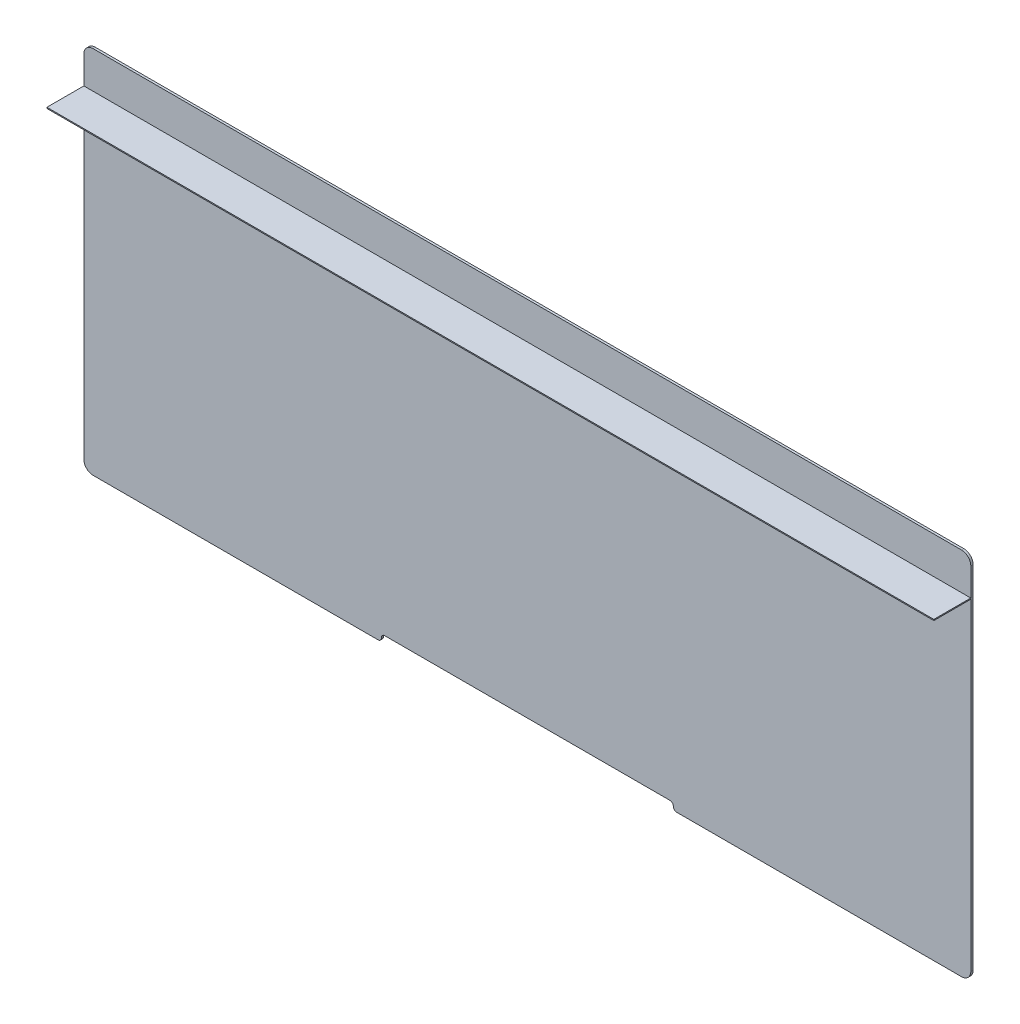
ISO-10303-21;
HEADER;
FILE_DESCRIPTION(('STEP AP214'),'2;1');
FILE_NAME('part.step','',(''),(''),'','','');
FILE_SCHEMA(('AUTOMOTIVE_DESIGN { 1 0 10303 214 1 1 1 1 }'));
ENDSEC;
DATA;
#1=APPLICATION_CONTEXT('core data for automotive mechanical design processes');
#2=APPLICATION_PROTOCOL_DEFINITION('international standard','automotive_design',2000,#1);
#3=PRODUCT_CONTEXT('',#1,'mechanical');
#4=PRODUCT('Part','Part','',(#3));
#5=PRODUCT_RELATED_PRODUCT_CATEGORY('part','',(#4));
#6=PRODUCT_DEFINITION_FORMATION('','',#4);
#7=PRODUCT_DEFINITION_CONTEXT('part definition',#1,'design');
#8=PRODUCT_DEFINITION('design','',#6,#7);
#9=PRODUCT_DEFINITION_SHAPE('','',#8);
#10=(LENGTH_UNIT() NAMED_UNIT(*) SI_UNIT(.MILLI.,.METRE.));
#11=(NAMED_UNIT(*) PLANE_ANGLE_UNIT() SI_UNIT($,.RADIAN.));
#12=(NAMED_UNIT(*) SI_UNIT($,.STERADIAN.) SOLID_ANGLE_UNIT());
#13=UNCERTAINTY_MEASURE_WITH_UNIT(LENGTH_MEASURE(1.E-05),#10,'distance_accuracy_value','');
#14=(GEOMETRIC_REPRESENTATION_CONTEXT(3) GLOBAL_UNCERTAINTY_ASSIGNED_CONTEXT((#13)) GLOBAL_UNIT_ASSIGNED_CONTEXT((#10,
#11,#12)) REPRESENTATION_CONTEXT('',''));
#15=CARTESIAN_POINT('',(0.,0.,0.));
#16=DIRECTION('',(0.,0.,1.));
#17=DIRECTION('',(1.,0.,0.));
#18=AXIS2_PLACEMENT_3D('',#15,#16,#17);
#19=CARTESIAN_POINT('',(-416.107853403142,106.182771727749,26.9875));
#20=DIRECTION('',(0.,1.,0.));
#21=DIRECTION('',(-1.,0.,0.));
#22=AXIS2_PLACEMENT_3D('',#19,#20,#21);
#23=PLANE('',#22);
#24=DIRECTION('',(1.,0.,0.));
#25=VECTOR('',#24,1.);
#26=CARTESIAN_POINT('',(-416.107853403142,106.182771727749,1.5875));
#27=LINE('',#26,#25);
#28=CARTESIAN_POINT('',(-416.107853403142,106.182771727749,1.5875));
#29=VERTEX_POINT('',#28);
#30=CARTESIAN_POINT('',(193.492146596859,106.182771727749,1.5875));
#31=VERTEX_POINT('',#30);
#32=EDGE_CURVE('E114',#29,#31,#27,.T.);
#33=ORIENTED_EDGE('',*,*,#32,.T.);
#34=DIRECTION('',(0.,0.,-1.));
#35=VECTOR('',#34,1.);
#36=CARTESIAN_POINT('',(193.492146596859,106.182771727749,26.9875));
#37=LINE('',#36,#35);
#38=CARTESIAN_POINT('',(193.492146596859,106.182771727749,26.9875));
#39=VERTEX_POINT('',#38);
#40=EDGE_CURVE('E12',#39,#31,#37,.T.);
#41=ORIENTED_EDGE('',*,*,#40,.F.);
#42=DIRECTION('',(1.,0.,0.));
#43=VECTOR('',#42,1.);
#44=CARTESIAN_POINT('',(-416.107853403142,106.182771727749,26.9875));
#45=LINE('',#44,#43);
#46=CARTESIAN_POINT('',(-416.107853403142,106.182771727749,26.9875));
#47=VERTEX_POINT('',#46);
#48=EDGE_CURVE('E91',#47,#39,#45,.T.);
#49=ORIENTED_EDGE('',*,*,#48,.F.);
#50=DIRECTION('',(0.,0.,-1.));
#51=VECTOR('',#50,1.);
#52=CARTESIAN_POINT('',(-416.107853403142,106.182771727749,26.9875));
#53=LINE('',#52,#51);
#54=EDGE_CURVE('E67',#47,#29,#53,.T.);
#55=ORIENTED_EDGE('',*,*,#54,.T.);
#56=EDGE_LOOP('',(#33,#41,#49,#55));
#57=FACE_BOUND('',#56,.T.);
#58=ADVANCED_FACE('F51',(#57),#23,.F.);
#59=CARTESIAN_POINT('',(193.492146596859,106.919371727749,26.9875));
#60=DIRECTION('',(1.,0.,0.));
#61=DIRECTION('',(0.,1.,0.));
#62=AXIS2_PLACEMENT_3D('',#59,#60,#61);
#63=PLANE('',#62);
#64=DIRECTION('',(0.,-1.,0.));
#65=VECTOR('',#64,1.);
#66=CARTESIAN_POINT('',(193.492146596859,106.919371727749,1.5875));
#67=LINE('',#66,#65);
#68=CARTESIAN_POINT('',(193.492146596859,106.919371727749,1.5875));
#69=VERTEX_POINT('',#68);
#70=EDGE_CURVE('E100',#69,#31,#67,.T.);
#71=ORIENTED_EDGE('',*,*,#70,.F.);
#72=DIRECTION('',(0.,0.,-1.));
#73=VECTOR('',#72,1.);
#74=CARTESIAN_POINT('',(193.492146596859,106.919371727749,26.9875));
#75=LINE('',#74,#73);
#76=CARTESIAN_POINT('',(193.492146596859,106.919371727749,26.9875));
#77=VERTEX_POINT('',#76);
#78=EDGE_CURVE('E59',#77,#69,#75,.T.);
#79=ORIENTED_EDGE('',*,*,#78,.F.);
#80=DIRECTION('',(0.,-1.,0.));
#81=VECTOR('',#80,1.);
#82=CARTESIAN_POINT('',(193.492146596859,106.919371727749,26.9875));
#83=LINE('',#82,#81);
#84=EDGE_CURVE('E98',#77,#39,#83,.T.);
#85=ORIENTED_EDGE('',*,*,#84,.T.);
#86=ORIENTED_EDGE('',*,*,#40,.T.);
#87=EDGE_LOOP('',(#71,#79,#85,#86));
#88=FACE_BOUND('',#87,.T.);
#89=ADVANCED_FACE('F97',(#88),#63,.T.);
#90=CARTESIAN_POINT('',(-416.107853403142,106.919371727749,26.9875));
#91=DIRECTION('',(0.,1.,0.));
#92=DIRECTION('',(-1.,0.,0.));
#93=AXIS2_PLACEMENT_3D('',#90,#91,#92);
#94=PLANE('',#93);
#95=DIRECTION('',(1.,0.,0.));
#96=VECTOR('',#95,1.);
#97=CARTESIAN_POINT('',(-416.107853403142,106.919371727749,1.5875));
#98=LINE('',#97,#96);
#99=CARTESIAN_POINT('',(-416.107853403142,106.919371727749,1.5875));
#100=VERTEX_POINT('',#99);
#101=EDGE_CURVE('E117',#100,#69,#98,.T.);
#102=ORIENTED_EDGE('',*,*,#101,.F.);
#103=DIRECTION('',(0.,0.,-1.));
#104=VECTOR('',#103,1.);
#105=CARTESIAN_POINT('',(-416.107853403142,106.919371727749,26.9875));
#106=LINE('',#105,#104);
#107=CARTESIAN_POINT('',(-416.107853403142,106.919371727749,26.9875));
#108=VERTEX_POINT('',#107);
#109=EDGE_CURVE('E80',#108,#100,#106,.T.);
#110=ORIENTED_EDGE('',*,*,#109,.F.);
#111=DIRECTION('',(1.,0.,0.));
#112=VECTOR('',#111,1.);
#113=CARTESIAN_POINT('',(-416.107853403142,106.919371727749,26.9875));
#114=LINE('',#113,#112);
#115=EDGE_CURVE('E106',#108,#77,#114,.T.);
#116=ORIENTED_EDGE('',*,*,#115,.T.);
#117=ORIENTED_EDGE('',*,*,#78,.T.);
#118=EDGE_LOOP('',(#102,#110,#116,#117));
#119=FACE_BOUND('',#118,.T.);
#120=ADVANCED_FACE('F108',(#119),#94,.T.);
#121=CARTESIAN_POINT('',(-416.107853403142,106.182771727749,26.9875));
#122=DIRECTION('',(-1.,0.,0.));
#123=DIRECTION('',(0.,0.,1.));
#124=AXIS2_PLACEMENT_3D('',#121,#122,#123);
#125=PLANE('',#124);
#126=DIRECTION('',(0.,1.,0.));
#127=VECTOR('',#126,1.);
#128=CARTESIAN_POINT('',(-416.107853403142,106.182771727749,1.5875));
#129=LINE('',#128,#127);
#130=EDGE_CURVE('E119',#29,#100,#129,.T.);
#131=ORIENTED_EDGE('',*,*,#130,.F.);
#132=ORIENTED_EDGE('',*,*,#54,.F.);
#133=DIRECTION('',(0.,1.,0.));
#134=VECTOR('',#133,1.);
#135=CARTESIAN_POINT('',(-416.107853403142,106.182771727749,26.9875));
#136=LINE('',#135,#134);
#137=EDGE_CURVE('E109',#47,#108,#136,.T.);
#138=ORIENTED_EDGE('',*,*,#137,.T.);
#139=ORIENTED_EDGE('',*,*,#109,.T.);
#140=EDGE_LOOP('',(#131,#132,#138,#139));
#141=FACE_BOUND('',#140,.T.);
#142=ADVANCED_FACE('F125',(#141),#125,.T.);
#143=CARTESIAN_POINT('',(0.,0.,26.9875));
#144=DIRECTION('',(0.,0.,-1.));
#145=DIRECTION('',(-1.,0.,0.));
#146=AXIS2_PLACEMENT_3D('',#143,#144,#145);
#147=PLANE('',#146);
#148=ORIENTED_EDGE('',*,*,#48,.T.);
#149=ORIENTED_EDGE('',*,*,#84,.F.);
#150=ORIENTED_EDGE('',*,*,#115,.F.);
#151=ORIENTED_EDGE('',*,*,#137,.F.);
#152=EDGE_LOOP('',(#148,#149,#150,#151));
#153=FACE_BOUND('',#152,.T.);
#154=ADVANCED_FACE('F105',(#153),#147,.F.);
#155=CARTESIAN_POINT('',(0.,0.,1.5875));
#156=DIRECTION('',(0.,0.,-1.));
#157=DIRECTION('',(-1.,0.,0.));
#158=AXIS2_PLACEMENT_3D('',#155,#156,#157);
#159=PLANE('',#158);
#160=ORIENTED_EDGE('',*,*,#32,.F.);
#161=ORIENTED_EDGE('',*,*,#130,.T.);
#162=ORIENTED_EDGE('',*,*,#101,.T.);
#163=ORIENTED_EDGE('',*,*,#70,.T.);
#164=EDGE_LOOP('',(#160,#161,#162,#163));
#165=FACE_BOUND('',#164,.T.);
#166=ADVANCED_FACE('F124',(#165),#159,.T.);
#167=CLOSED_SHELL('',(#58,#89,#120,#142,#154,#166));
#168=MANIFOLD_SOLID_BREP('B2',#167);
#169=CARTESIAN_POINT('',(-409.757853403141,-115.330628272251,1.5875));
#170=DIRECTION('',(0.,0.,-1.));
#171=DIRECTION('',(-1.,0.,0.));
#172=AXIS2_PLACEMENT_3D('',#169,#170,#171);
#173=CYLINDRICAL_SURFACE('',#172,6.35000000000001);
#174=CARTESIAN_POINT('',(-409.757853403141,-115.330628272251,0.));
#175=DIRECTION('',(0.,0.,1.));
#176=DIRECTION('',(1.,0.,0.));
#177=AXIS2_PLACEMENT_3D('',#174,#175,#176);
#178=CIRCLE('',#177,6.35000000000001);
#179=CARTESIAN_POINT('',(-416.107853403141,-115.330628272251,0.));
#180=VERTEX_POINT('',#179);
#181=CARTESIAN_POINT('',(-409.757853403141,-121.680628272251,0.));
#182=VERTEX_POINT('',#181);
#183=EDGE_CURVE('E336',#180,#182,#178,.T.);
#184=ORIENTED_EDGE('',*,*,#183,.T.);
#185=DIRECTION('',(0.,0.,-1.));
#186=VECTOR('',#185,1.);
#187=CARTESIAN_POINT('',(-409.757853403141,-121.680628272251,1.5875));
#188=LINE('',#187,#186);
#189=CARTESIAN_POINT('',(-409.757853403141,-121.680628272251,1.5875));
#190=VERTEX_POINT('',#189);
#191=EDGE_CURVE('E49',#190,#182,#188,.T.);
#192=ORIENTED_EDGE('',*,*,#191,.F.);
#193=CARTESIAN_POINT('',(-409.757853403141,-115.330628272251,1.5875));
#194=DIRECTION('',(0.,0.,1.));
#195=DIRECTION('',(1.,0.,0.));
#196=AXIS2_PLACEMENT_3D('',#193,#194,#195);
#197=CIRCLE('',#196,6.35000000000001);
#198=CARTESIAN_POINT('',(-416.107853403141,-115.330628272251,1.5875));
#199=VERTEX_POINT('',#198);
#200=EDGE_CURVE('E382',#199,#190,#197,.T.);
#201=ORIENTED_EDGE('',*,*,#200,.F.);
#202=DIRECTION('',(0.,0.,-1.));
#203=VECTOR('',#202,1.);
#204=CARTESIAN_POINT('',(-416.107853403141,-115.330628272251,1.5875));
#205=LINE('',#204,#203);
#206=EDGE_CURVE('E332',#199,#180,#205,.T.);
#207=ORIENTED_EDGE('',*,*,#206,.T.);
#208=EDGE_LOOP('',(#184,#192,#201,#207));
#209=FACE_BOUND('',#208,.T.);
#210=ADVANCED_FACE('F187',(#209),#173,.T.);
#211=CARTESIAN_POINT('',(-409.757853403141,-121.680628272251,1.5875));
#212=DIRECTION('',(0.,1.,0.));
#213=DIRECTION('',(0.,0.,1.));
#214=AXIS2_PLACEMENT_3D('',#211,#212,#213);
#215=PLANE('',#214);
#216=DIRECTION('',(1.,0.,0.));
#217=VECTOR('',#216,1.);
#218=CARTESIAN_POINT('',(-409.757853403141,-121.680628272251,0.));
#219=LINE('',#218,#217);
#220=CARTESIAN_POINT('',(-213.923853403141,-121.680628272251,0.));
#221=VERTEX_POINT('',#220);
#222=EDGE_CURVE('E340',#182,#221,#219,.T.);
#223=ORIENTED_EDGE('',*,*,#222,.T.);
#224=DIRECTION('',(0.,0.,-1.));
#225=VECTOR('',#224,1.);
#226=CARTESIAN_POINT('',(-213.923853403141,-121.680628272251,1.5875));
#227=LINE('',#226,#225);
#228=CARTESIAN_POINT('',(-213.923853403141,-121.680628272251,1.5875));
#229=VERTEX_POINT('',#228);
#230=EDGE_CURVE('E196',#229,#221,#227,.T.);
#231=ORIENTED_EDGE('',*,*,#230,.F.);
#232=DIRECTION('',(1.,0.,0.));
#233=VECTOR('',#232,1.);
#234=CARTESIAN_POINT('',(-409.757853403141,-121.680628272251,1.5875));
#235=LINE('',#234,#233);
#236=EDGE_CURVE('E271',#190,#229,#235,.T.);
#237=ORIENTED_EDGE('',*,*,#236,.F.);
#238=ORIENTED_EDGE('',*,*,#191,.T.);
#239=EDGE_LOOP('',(#223,#231,#237,#238));
#240=FACE_BOUND('',#239,.T.);
#241=ADVANCED_FACE('F504',(#240),#215,.F.);
#242=CARTESIAN_POINT('',(-213.923853403141,-119.394628272251,1.5875));
#243=DIRECTION('',(0.,0.,-1.));
#244=DIRECTION('',(-1.,0.,0.));
#245=AXIS2_PLACEMENT_3D('',#242,#243,#244);
#246=CYLINDRICAL_SURFACE('',#245,2.286);
#247=CARTESIAN_POINT('',(-213.923853403141,-119.394628272251,0.));
#248=DIRECTION('',(0.,0.,1.));
#249=DIRECTION('',(1.,0.,0.));
#250=AXIS2_PLACEMENT_3D('',#247,#248,#249);
#251=CIRCLE('',#250,2.286);
#252=CARTESIAN_POINT('',(-211.637853403141,-119.394628272251,0.));
#253=VERTEX_POINT('',#252);
#254=EDGE_CURVE('E343',#221,#253,#251,.T.);
#255=ORIENTED_EDGE('',*,*,#254,.T.);
#256=DIRECTION('',(0.,0.,-1.));
#257=VECTOR('',#256,1.);
#258=CARTESIAN_POINT('',(-211.637853403141,-119.394628272251,1.5875));
#259=LINE('',#258,#257);
#260=CARTESIAN_POINT('',(-211.637853403141,-119.394628272251,1.5875));
#261=VERTEX_POINT('',#260);
#262=EDGE_CURVE('E425',#261,#253,#259,.T.);
#263=ORIENTED_EDGE('',*,*,#262,.F.);
#264=CARTESIAN_POINT('',(-213.923853403141,-119.394628272251,1.5875));
#265=DIRECTION('',(0.,0.,1.));
#266=DIRECTION('',(1.,0.,0.));
#267=AXIS2_PLACEMENT_3D('',#264,#265,#266);
#268=CIRCLE('',#267,2.286);
#269=EDGE_CURVE('E435',#229,#261,#268,.T.);
#270=ORIENTED_EDGE('',*,*,#269,.F.);
#271=ORIENTED_EDGE('',*,*,#230,.T.);
#272=EDGE_LOOP('',(#255,#263,#270,#271));
#273=FACE_BOUND('',#272,.T.);
#274=ADVANCED_FACE('F433',(#273),#246,.T.);
#275=CARTESIAN_POINT('',(-211.637853403141,-119.394628272251,1.5875));
#276=DIRECTION('',(-1.,0.,0.));
#277=DIRECTION('',(0.,0.,1.));
#278=AXIS2_PLACEMENT_3D('',#275,#276,#277);
#279=PLANE('',#278);
#280=DIRECTION('',(0.,1.,0.));
#281=VECTOR('',#280,1.);
#282=CARTESIAN_POINT('',(-211.637853403141,-119.394628272251,0.));
#283=LINE('',#282,#281);
#284=CARTESIAN_POINT('',(-211.637853403141,-119.204128272251,0.));
#285=VERTEX_POINT('',#284);
#286=EDGE_CURVE('E346',#253,#285,#283,.T.);
#287=ORIENTED_EDGE('',*,*,#286,.T.);
#288=DIRECTION('',(0.,0.,-1.));
#289=VECTOR('',#288,1.);
#290=CARTESIAN_POINT('',(-211.637853403141,-119.204128272251,1.5875));
#291=LINE('',#290,#289);
#292=CARTESIAN_POINT('',(-211.637853403141,-119.204128272251,1.5875));
#293=VERTEX_POINT('',#292);
#294=EDGE_CURVE('E421',#293,#285,#291,.T.);
#295=ORIENTED_EDGE('',*,*,#294,.F.);
#296=DIRECTION('',(0.,1.,0.));
#297=VECTOR('',#296,1.);
#298=CARTESIAN_POINT('',(-211.637853403141,-119.394628272251,1.5875));
#299=LINE('',#298,#297);
#300=EDGE_CURVE('E454',#261,#293,#299,.T.);
#301=ORIENTED_EDGE('',*,*,#300,.F.);
#302=ORIENTED_EDGE('',*,*,#262,.T.);
#303=EDGE_LOOP('',(#287,#295,#301,#302));
#304=FACE_BOUND('',#303,.T.);
#305=ADVANCED_FACE('F444',(#304),#279,.F.);
#306=CARTESIAN_POINT('',(-209.351853403141,-119.204128272251,1.5875));
#307=DIRECTION('',(0.,0.,-1.));
#308=DIRECTION('',(-1.,0.,0.));
#309=AXIS2_PLACEMENT_3D('',#306,#307,#308);
#310=CYLINDRICAL_SURFACE('',#309,2.286);
#311=CARTESIAN_POINT('',(-209.351853403141,-119.204128272251,0.));
#312=DIRECTION('',(0.,0.,-1.));
#313=DIRECTION('',(-1.,0.,0.));
#314=AXIS2_PLACEMENT_3D('',#311,#312,#313);
#315=CIRCLE('',#314,2.286);
#316=CARTESIAN_POINT('',(-209.351853403141,-116.918128272251,0.));
#317=VERTEX_POINT('',#316);
#318=EDGE_CURVE('E349',#285,#317,#315,.T.);
#319=ORIENTED_EDGE('',*,*,#318,.T.);
#320=DIRECTION('',(0.,0.,-1.));
#321=VECTOR('',#320,1.);
#322=CARTESIAN_POINT('',(-209.351853403141,-116.918128272251,1.5875));
#323=LINE('',#322,#321);
#324=CARTESIAN_POINT('',(-209.351853403141,-116.918128272251,1.5875));
#325=VERTEX_POINT('',#324);
#326=EDGE_CURVE('E417',#325,#317,#323,.T.);
#327=ORIENTED_EDGE('',*,*,#326,.F.);
#328=CARTESIAN_POINT('',(-209.351853403141,-119.204128272251,1.5875));
#329=DIRECTION('',(0.,0.,-1.));
#330=DIRECTION('',(-1.,0.,0.));
#331=AXIS2_PLACEMENT_3D('',#328,#329,#330);
#332=CIRCLE('',#331,2.286);
#333=EDGE_CURVE('E450',#293,#325,#332,.T.);
#334=ORIENTED_EDGE('',*,*,#333,.F.);
#335=ORIENTED_EDGE('',*,*,#294,.T.);
#336=EDGE_LOOP('',(#319,#327,#334,#335));
#337=FACE_BOUND('',#336,.T.);
#338=ADVANCED_FACE('F448',(#337),#310,.F.);
#339=CARTESIAN_POINT('',(-209.351853403141,-116.918128272251,1.5875));
#340=DIRECTION('',(0.,1.,0.));
#341=DIRECTION('',(0.,0.,1.));
#342=AXIS2_PLACEMENT_3D('',#339,#340,#341);
#343=PLANE('',#342);
#344=DIRECTION('',(1.,0.,0.));
#345=VECTOR('',#344,1.);
#346=CARTESIAN_POINT('',(-209.351853403141,-116.918128272251,0.));
#347=LINE('',#346,#345);
#348=CARTESIAN_POINT('',(-13.2638534031415,-116.918128272251,0.));
#349=VERTEX_POINT('',#348);
#350=EDGE_CURVE('E352',#317,#349,#347,.T.);
#351=ORIENTED_EDGE('',*,*,#350,.T.);
#352=DIRECTION('',(0.,0.,-1.));
#353=VECTOR('',#352,1.);
#354=CARTESIAN_POINT('',(-13.2638534031415,-116.918128272251,1.5875));
#355=LINE('',#354,#353);
#356=CARTESIAN_POINT('',(-13.2638534031415,-116.918128272251,1.5875));
#357=VERTEX_POINT('',#356);
#358=EDGE_CURVE('E413',#357,#349,#355,.T.);
#359=ORIENTED_EDGE('',*,*,#358,.F.);
#360=DIRECTION('',(1.,0.,0.));
#361=VECTOR('',#360,1.);
#362=CARTESIAN_POINT('',(-209.351853403141,-116.918128272251,1.5875));
#363=LINE('',#362,#361);
#364=EDGE_CURVE('E453',#325,#357,#363,.T.);
#365=ORIENTED_EDGE('',*,*,#364,.F.);
#366=ORIENTED_EDGE('',*,*,#326,.T.);
#367=EDGE_LOOP('',(#351,#359,#365,#366));
#368=FACE_BOUND('',#367,.T.);
#369=ADVANCED_FACE('F517',(#368),#343,.F.);
#370=CARTESIAN_POINT('',(-13.2638534031415,-119.204128272251,1.5875));
#371=DIRECTION('',(0.,0.,-1.));
#372=DIRECTION('',(-1.,0.,0.));
#373=AXIS2_PLACEMENT_3D('',#370,#371,#372);
#374=CYLINDRICAL_SURFACE('',#373,2.286);
#375=CARTESIAN_POINT('',(-13.2638534031415,-119.204128272251,0.));
#376=DIRECTION('',(0.,0.,-1.));
#377=DIRECTION('',(-1.,0.,0.));
#378=AXIS2_PLACEMENT_3D('',#375,#376,#377);
#379=CIRCLE('',#378,2.286);
#380=CARTESIAN_POINT('',(-10.9778534031415,-119.204128272251,0.));
#381=VERTEX_POINT('',#380);
#382=EDGE_CURVE('E355',#349,#381,#379,.T.);
#383=ORIENTED_EDGE('',*,*,#382,.T.);
#384=DIRECTION('',(0.,0.,-1.));
#385=VECTOR('',#384,1.);
#386=CARTESIAN_POINT('',(-10.9778534031415,-119.204128272251,1.5875));
#387=LINE('',#386,#385);
#388=CARTESIAN_POINT('',(-10.9778534031415,-119.204128272251,1.5875));
#389=VERTEX_POINT('',#388);
#390=EDGE_CURVE('E409',#389,#381,#387,.T.);
#391=ORIENTED_EDGE('',*,*,#390,.F.);
#392=CARTESIAN_POINT('',(-13.2638534031415,-119.204128272251,1.5875));
#393=DIRECTION('',(0.,0.,-1.));
#394=DIRECTION('',(-1.,0.,0.));
#395=AXIS2_PLACEMENT_3D('',#392,#393,#394);
#396=CIRCLE('',#395,2.286);
#397=EDGE_CURVE('E458',#357,#389,#396,.T.);
#398=ORIENTED_EDGE('',*,*,#397,.F.);
#399=ORIENTED_EDGE('',*,*,#358,.T.);
#400=EDGE_LOOP('',(#383,#391,#398,#399));
#401=FACE_BOUND('',#400,.T.);
#402=ADVANCED_FACE('F520',(#401),#374,.F.);
#403=CARTESIAN_POINT('',(-10.9778534031415,-119.204128272251,1.5875));
#404=DIRECTION('',(1.,0.,0.));
#405=DIRECTION('',(0.,0.,-1.));
#406=AXIS2_PLACEMENT_3D('',#403,#404,#405);
#407=PLANE('',#406);
#408=DIRECTION('',(0.,-1.,0.));
#409=VECTOR('',#408,1.);
#410=CARTESIAN_POINT('',(-10.9778534031415,-119.204128272251,0.));
#411=LINE('',#410,#409);
#412=CARTESIAN_POINT('',(-10.9778534031415,-119.394628272251,0.));
#413=VERTEX_POINT('',#412);
#414=EDGE_CURVE('E358',#381,#413,#411,.T.);
#415=ORIENTED_EDGE('',*,*,#414,.T.);
#416=DIRECTION('',(0.,0.,-1.));
#417=VECTOR('',#416,1.);
#418=CARTESIAN_POINT('',(-10.9778534031415,-119.394628272251,1.5875));
#419=LINE('',#418,#417);
#420=CARTESIAN_POINT('',(-10.9778534031415,-119.394628272251,1.5875));
#421=VERTEX_POINT('',#420);
#422=EDGE_CURVE('E405',#421,#413,#419,.T.);
#423=ORIENTED_EDGE('',*,*,#422,.F.);
#424=DIRECTION('',(0.,-1.,0.));
#425=VECTOR('',#424,1.);
#426=CARTESIAN_POINT('',(-10.9778534031415,-119.204128272251,1.5875));
#427=LINE('',#426,#425);
#428=EDGE_CURVE('E465',#389,#421,#427,.T.);
#429=ORIENTED_EDGE('',*,*,#428,.F.);
#430=ORIENTED_EDGE('',*,*,#390,.T.);
#431=EDGE_LOOP('',(#415,#423,#429,#430));
#432=FACE_BOUND('',#431,.T.);
#433=ADVANCED_FACE('F524',(#432),#407,.F.);
#434=CARTESIAN_POINT('',(-8.69185340314147,-119.394628272251,1.5875));
#435=DIRECTION('',(0.,0.,-1.));
#436=DIRECTION('',(-1.,0.,0.));
#437=AXIS2_PLACEMENT_3D('',#434,#435,#436);
#438=CYLINDRICAL_SURFACE('',#437,2.286);
#439=CARTESIAN_POINT('',(-8.69185340314147,-119.394628272251,0.));
#440=DIRECTION('',(0.,0.,1.));
#441=DIRECTION('',(1.,0.,0.));
#442=AXIS2_PLACEMENT_3D('',#439,#440,#441);
#443=CIRCLE('',#442,2.286);
#444=CARTESIAN_POINT('',(-8.69185340314146,-121.680628272251,0.));
#445=VERTEX_POINT('',#444);
#446=EDGE_CURVE('E361',#413,#445,#443,.T.);
#447=ORIENTED_EDGE('',*,*,#446,.T.);
#448=DIRECTION('',(0.,0.,-1.));
#449=VECTOR('',#448,1.);
#450=CARTESIAN_POINT('',(-8.69185340314146,-121.680628272251,1.5875));
#451=LINE('',#450,#449);
#452=CARTESIAN_POINT('',(-8.69185340314146,-121.680628272251,1.5875));
#453=VERTEX_POINT('',#452);
#454=EDGE_CURVE('E401',#453,#445,#451,.T.);
#455=ORIENTED_EDGE('',*,*,#454,.F.);
#456=CARTESIAN_POINT('',(-8.69185340314147,-119.394628272251,1.5875));
#457=DIRECTION('',(0.,0.,1.));
#458=DIRECTION('',(1.,0.,0.));
#459=AXIS2_PLACEMENT_3D('',#456,#457,#458);
#460=CIRCLE('',#459,2.286);
#461=EDGE_CURVE('E468',#421,#453,#460,.T.);
#462=ORIENTED_EDGE('',*,*,#461,.F.);
#463=ORIENTED_EDGE('',*,*,#422,.T.);
#464=EDGE_LOOP('',(#447,#455,#462,#463));
#465=FACE_BOUND('',#464,.T.);
#466=ADVANCED_FACE('F528',(#465),#438,.T.);
#467=CARTESIAN_POINT('',(-8.69185340314146,-121.680628272251,1.5875));
#468=DIRECTION('',(0.,1.,0.));
#469=DIRECTION('',(0.,0.,1.));
#470=AXIS2_PLACEMENT_3D('',#467,#468,#469);
#471=PLANE('',#470);
#472=DIRECTION('',(1.,0.,0.));
#473=VECTOR('',#472,1.);
#474=CARTESIAN_POINT('',(-8.69185340314146,-121.680628272251,0.));
#475=LINE('',#474,#473);
#476=CARTESIAN_POINT('',(187.142146596859,-121.680628272251,0.));
#477=VERTEX_POINT('',#476);
#478=EDGE_CURVE('E364',#445,#477,#475,.T.);
#479=ORIENTED_EDGE('',*,*,#478,.T.);
#480=DIRECTION('',(0.,0.,-1.));
#481=VECTOR('',#480,1.);
#482=CARTESIAN_POINT('',(187.142146596859,-121.680628272251,1.5875));
#483=LINE('',#482,#481);
#484=CARTESIAN_POINT('',(187.142146596859,-121.680628272251,1.5875));
#485=VERTEX_POINT('',#484);
#486=EDGE_CURVE('E397',#485,#477,#483,.T.);
#487=ORIENTED_EDGE('',*,*,#486,.F.);
#488=DIRECTION('',(1.,0.,0.));
#489=VECTOR('',#488,1.);
#490=CARTESIAN_POINT('',(-8.69185340314146,-121.680628272251,1.5875));
#491=LINE('',#490,#489);
#492=EDGE_CURVE('E471',#453,#485,#491,.T.);
#493=ORIENTED_EDGE('',*,*,#492,.F.);
#494=ORIENTED_EDGE('',*,*,#454,.T.);
#495=EDGE_LOOP('',(#479,#487,#493,#494));
#496=FACE_BOUND('',#495,.T.);
#497=ADVANCED_FACE('F532',(#496),#471,.F.);
#498=CARTESIAN_POINT('',(187.142146596859,-115.330628272251,1.5875));
#499=DIRECTION('',(0.,0.,-1.));
#500=DIRECTION('',(-1.,0.,0.));
#501=AXIS2_PLACEMENT_3D('',#498,#499,#500);
#502=CYLINDRICAL_SURFACE('',#501,6.35000000000002);
#503=CARTESIAN_POINT('',(187.142146596859,-115.330628272251,0.));
#504=DIRECTION('',(0.,0.,1.));
#505=DIRECTION('',(1.,0.,0.));
#506=AXIS2_PLACEMENT_3D('',#503,#504,#505);
#507=CIRCLE('',#506,6.35000000000002);
#508=CARTESIAN_POINT('',(193.492146596859,-115.330628272251,0.));
#509=VERTEX_POINT('',#508);
#510=EDGE_CURVE('E367',#477,#509,#507,.T.);
#511=ORIENTED_EDGE('',*,*,#510,.T.);
#512=DIRECTION('',(0.,0.,-1.));
#513=VECTOR('',#512,1.);
#514=CARTESIAN_POINT('',(193.492146596859,-115.330628272251,1.5875));
#515=LINE('',#514,#513);
#516=CARTESIAN_POINT('',(193.492146596859,-115.330628272251,1.5875));
#517=VERTEX_POINT('',#516);
#518=EDGE_CURVE('E393',#517,#509,#515,.T.);
#519=ORIENTED_EDGE('',*,*,#518,.F.);
#520=CARTESIAN_POINT('',(187.142146596859,-115.330628272251,1.5875));
#521=DIRECTION('',(0.,0.,1.));
#522=DIRECTION('',(1.,0.,0.));
#523=AXIS2_PLACEMENT_3D('',#520,#521,#522);
#524=CIRCLE('',#523,6.35000000000002);
#525=EDGE_CURVE('E474',#485,#517,#524,.T.);
#526=ORIENTED_EDGE('',*,*,#525,.F.);
#527=ORIENTED_EDGE('',*,*,#486,.T.);
#528=EDGE_LOOP('',(#511,#519,#526,#527));
#529=FACE_BOUND('',#528,.T.);
#530=ADVANCED_FACE('F536',(#529),#502,.T.);
#531=CARTESIAN_POINT('',(193.492146596859,125.969371727749,1.5875));
#532=DIRECTION('',(-1.,0.,0.));
#533=DIRECTION('',(0.,-1.,0.));
#534=AXIS2_PLACEMENT_3D('',#531,#532,#533);
#535=PLANE('',#534);
#536=DIRECTION('',(0.,1.,0.));
#537=VECTOR('',#536,1.);
#538=CARTESIAN_POINT('',(193.492146596859,125.969371727749,0.));
#539=LINE('',#538,#537);
#540=CARTESIAN_POINT('',(193.492146596859,125.969371727749,0.));
#541=VERTEX_POINT('',#540);
#542=EDGE_CURVE('E370',#509,#541,#539,.T.);
#543=ORIENTED_EDGE('',*,*,#542,.T.);
#544=DIRECTION('',(0.,0.,-1.));
#545=VECTOR('',#544,1.);
#546=CARTESIAN_POINT('',(193.492146596859,125.969371727749,1.5875));
#547=LINE('',#546,#545);
#548=CARTESIAN_POINT('',(193.492146596859,125.969371727749,1.5875));
#549=VERTEX_POINT('',#548);
#550=EDGE_CURVE('E389',#549,#541,#547,.T.);
#551=ORIENTED_EDGE('',*,*,#550,.F.);
#552=DIRECTION('',(0.,1.,0.));
#553=VECTOR('',#552,1.);
#554=CARTESIAN_POINT('',(193.492146596859,125.969371727749,1.5875));
#555=LINE('',#554,#553);
#556=EDGE_CURVE('E477',#517,#549,#555,.T.);
#557=ORIENTED_EDGE('',*,*,#556,.F.);
#558=ORIENTED_EDGE('',*,*,#518,.T.);
#559=EDGE_LOOP('',(#543,#551,#557,#558));
#560=FACE_BOUND('',#559,.T.);
#561=ADVANCED_FACE('F485',(#560),#535,.F.);
#562=CARTESIAN_POINT('',(187.142146596859,125.969371727749,1.5875));
#563=DIRECTION('',(0.,0.,-1.));
#564=DIRECTION('',(-1.,0.,0.));
#565=AXIS2_PLACEMENT_3D('',#562,#563,#564);
#566=CYLINDRICAL_SURFACE('',#565,6.34999999999999);
#567=CARTESIAN_POINT('',(187.142146596859,125.969371727749,0.));
#568=DIRECTION('',(0.,0.,1.));
#569=DIRECTION('',(-1.,0.,0.));
#570=AXIS2_PLACEMENT_3D('',#567,#568,#569);
#571=CIRCLE('',#570,6.34999999999999);
#572=CARTESIAN_POINT('',(187.142146596859,132.319371727749,0.));
#573=VERTEX_POINT('',#572);
#574=EDGE_CURVE('E373',#541,#573,#571,.T.);
#575=ORIENTED_EDGE('',*,*,#574,.T.);
#576=DIRECTION('',(0.,0.,-1.));
#577=VECTOR('',#576,1.);
#578=CARTESIAN_POINT('',(187.142146596859,132.319371727749,1.5875));
#579=LINE('',#578,#577);
#580=CARTESIAN_POINT('',(187.142146596859,132.319371727749,1.5875));
#581=VERTEX_POINT('',#580);
#582=EDGE_CURVE('E325',#581,#573,#579,.T.);
#583=ORIENTED_EDGE('',*,*,#582,.F.);
#584=CARTESIAN_POINT('',(187.142146596859,125.969371727749,1.5875));
#585=DIRECTION('',(0.,0.,1.));
#586=DIRECTION('',(-1.,0.,0.));
#587=AXIS2_PLACEMENT_3D('',#584,#585,#586);
#588=CIRCLE('',#587,6.34999999999999);
#589=EDGE_CURVE('E314',#549,#581,#588,.T.);
#590=ORIENTED_EDGE('',*,*,#589,.F.);
#591=ORIENTED_EDGE('',*,*,#550,.T.);
#592=EDGE_LOOP('',(#575,#583,#590,#591));
#593=FACE_BOUND('',#592,.T.);
#594=ADVANCED_FACE('F489',(#593),#566,.T.);
#595=CARTESIAN_POINT('',(-409.757853403141,132.319371727749,1.5875));
#596=DIRECTION('',(0.,-1.,0.));
#597=DIRECTION('',(0.,0.,-1.));
#598=AXIS2_PLACEMENT_3D('',#595,#596,#597);
#599=PLANE('',#598);
#600=DIRECTION('',(-1.,0.,0.));
#601=VECTOR('',#600,1.);
#602=CARTESIAN_POINT('',(-409.757853403141,132.319371727749,0.));
#603=LINE('',#602,#601);
#604=CARTESIAN_POINT('',(-409.757853403141,132.319371727749,0.));
#605=VERTEX_POINT('',#604);
#606=EDGE_CURVE('E323',#573,#605,#603,.T.);
#607=ORIENTED_EDGE('',*,*,#606,.T.);
#608=DIRECTION('',(0.,0.,-1.));
#609=VECTOR('',#608,1.);
#610=CARTESIAN_POINT('',(-409.757853403141,132.319371727749,1.5875));
#611=LINE('',#610,#609);
#612=CARTESIAN_POINT('',(-409.757853403141,132.319371727749,1.5875));
#613=VERTEX_POINT('',#612);
#614=EDGE_CURVE('E320',#613,#605,#611,.T.);
#615=ORIENTED_EDGE('',*,*,#614,.F.);
#616=DIRECTION('',(-1.,0.,0.));
#617=VECTOR('',#616,1.);
#618=CARTESIAN_POINT('',(-409.757853403141,132.319371727749,1.5875));
#619=LINE('',#618,#617);
#620=EDGE_CURVE('E308',#581,#613,#619,.T.);
#621=ORIENTED_EDGE('',*,*,#620,.F.);
#622=ORIENTED_EDGE('',*,*,#582,.T.);
#623=EDGE_LOOP('',(#607,#615,#621,#622));
#624=FACE_BOUND('',#623,.T.);
#625=ADVANCED_FACE('F321',(#624),#599,.F.);
#626=CARTESIAN_POINT('',(-409.757853403141,125.969371727749,1.5875));
#627=DIRECTION('',(0.,0.,-1.));
#628=DIRECTION('',(-1.,0.,0.));
#629=AXIS2_PLACEMENT_3D('',#626,#627,#628);
#630=CYLINDRICAL_SURFACE('',#629,6.35000000000001);
#631=CARTESIAN_POINT('',(-409.757853403141,125.969371727749,0.));
#632=DIRECTION('',(0.,0.,1.));
#633=DIRECTION('',(1.,0.,0.));
#634=AXIS2_PLACEMENT_3D('',#631,#632,#633);
#635=CIRCLE('',#634,6.35000000000001);
#636=CARTESIAN_POINT('',(-416.107853403142,125.969371727749,0.));
#637=VERTEX_POINT('',#636);
#638=EDGE_CURVE('E257',#605,#637,#635,.T.);
#639=ORIENTED_EDGE('',*,*,#638,.T.);
#640=DIRECTION('',(0.,0.,-1.));
#641=VECTOR('',#640,1.);
#642=CARTESIAN_POINT('',(-416.107853403142,125.969371727749,1.5875));
#643=LINE('',#642,#641);
#644=CARTESIAN_POINT('',(-416.107853403142,125.969371727749,1.5875));
#645=VERTEX_POINT('',#644);
#646=EDGE_CURVE('E326',#645,#637,#643,.T.);
#647=ORIENTED_EDGE('',*,*,#646,.F.);
#648=CARTESIAN_POINT('',(-409.757853403141,125.969371727749,1.5875));
#649=DIRECTION('',(0.,0.,1.));
#650=DIRECTION('',(1.,0.,0.));
#651=AXIS2_PLACEMENT_3D('',#648,#649,#650);
#652=CIRCLE('',#651,6.35000000000001);
#653=EDGE_CURVE('E312',#613,#645,#652,.T.);
#654=ORIENTED_EDGE('',*,*,#653,.F.);
#655=ORIENTED_EDGE('',*,*,#614,.T.);
#656=EDGE_LOOP('',(#639,#647,#654,#655));
#657=FACE_BOUND('',#656,.T.);
#658=ADVANCED_FACE('F328',(#657),#630,.T.);
#659=CARTESIAN_POINT('',(-416.107853403142,125.969371727749,1.5875));
#660=DIRECTION('',(1.,0.,0.));
#661=DIRECTION('',(0.,1.,0.));
#662=AXIS2_PLACEMENT_3D('',#659,#660,#661);
#663=PLANE('',#662);
#664=DIRECTION('',(0.,-1.,0.));
#665=VECTOR('',#664,1.);
#666=CARTESIAN_POINT('',(-416.107853403142,125.969371727749,0.));
#667=LINE('',#666,#665);
#668=EDGE_CURVE('E263',#637,#180,#667,.T.);
#669=ORIENTED_EDGE('',*,*,#668,.T.);
#670=ORIENTED_EDGE('',*,*,#206,.F.);
#671=DIRECTION('',(0.,-1.,0.));
#672=VECTOR('',#671,1.);
#673=CARTESIAN_POINT('',(-416.107853403142,125.969371727749,1.5875));
#674=LINE('',#673,#672);
#675=EDGE_CURVE('E204',#645,#199,#674,.T.);
#676=ORIENTED_EDGE('',*,*,#675,.F.);
#677=ORIENTED_EDGE('',*,*,#646,.T.);
#678=EDGE_LOOP('',(#669,#670,#676,#677));
#679=FACE_BOUND('',#678,.T.);
#680=ADVANCED_FACE('F493',(#679),#663,.F.);
#681=CARTESIAN_POINT('',(-409.757853403141,-115.330628272251,1.5875));
#682=DIRECTION('',(0.,0.,1.));
#683=DIRECTION('',(1.,0.,0.));
#684=AXIS2_PLACEMENT_3D('',#681,#682,#683);
#685=PLANE('',#684);
#686=ORIENTED_EDGE('',*,*,#200,.T.);
#687=ORIENTED_EDGE('',*,*,#236,.T.);
#688=ORIENTED_EDGE('',*,*,#269,.T.);
#689=ORIENTED_EDGE('',*,*,#300,.T.);
#690=ORIENTED_EDGE('',*,*,#333,.T.);
#691=ORIENTED_EDGE('',*,*,#364,.T.);
#692=ORIENTED_EDGE('',*,*,#397,.T.);
#693=ORIENTED_EDGE('',*,*,#428,.T.);
#694=ORIENTED_EDGE('',*,*,#461,.T.);
#695=ORIENTED_EDGE('',*,*,#492,.T.);
#696=ORIENTED_EDGE('',*,*,#525,.T.);
#697=ORIENTED_EDGE('',*,*,#556,.T.);
#698=ORIENTED_EDGE('',*,*,#589,.T.);
#699=ORIENTED_EDGE('',*,*,#620,.T.);
#700=ORIENTED_EDGE('',*,*,#653,.T.);
#701=ORIENTED_EDGE('',*,*,#675,.T.);
#702=EDGE_LOOP('',(#686,#687,#688,#689,#690,#691,#692,#693,#694,#695,#696,#697,#698,#699,#700,#701));
#703=FACE_BOUND('',#702,.T.);
#704=ADVANCED_FACE('F310',(#703),#685,.T.);
#705=CARTESIAN_POINT('',(-409.757853403141,-115.330628272251,0.));
#706=DIRECTION('',(0.,0.,1.));
#707=DIRECTION('',(1.,0.,0.));
#708=AXIS2_PLACEMENT_3D('',#705,#706,#707);
#709=PLANE('',#708);
#710=ORIENTED_EDGE('',*,*,#183,.F.);
#711=ORIENTED_EDGE('',*,*,#668,.F.);
#712=ORIENTED_EDGE('',*,*,#638,.F.);
#713=ORIENTED_EDGE('',*,*,#606,.F.);
#714=ORIENTED_EDGE('',*,*,#574,.F.);
#715=ORIENTED_EDGE('',*,*,#542,.F.);
#716=ORIENTED_EDGE('',*,*,#510,.F.);
#717=ORIENTED_EDGE('',*,*,#478,.F.);
#718=ORIENTED_EDGE('',*,*,#446,.F.);
#719=ORIENTED_EDGE('',*,*,#414,.F.);
#720=ORIENTED_EDGE('',*,*,#382,.F.);
#721=ORIENTED_EDGE('',*,*,#350,.F.);
#722=ORIENTED_EDGE('',*,*,#318,.F.);
#723=ORIENTED_EDGE('',*,*,#286,.F.);
#724=ORIENTED_EDGE('',*,*,#254,.F.);
#725=ORIENTED_EDGE('',*,*,#222,.F.);
#726=EDGE_LOOP('',(#710,#711,#712,#713,#714,#715,#716,#717,#718,#719,#720,#721,#722,#723,#724,#725));
#727=FACE_BOUND('',#726,.T.);
#728=ADVANCED_FACE('F439',(#727),#709,.F.);
#729=CLOSED_SHELL('',(#210,#241,#274,#305,#338,#369,#402,#433,#466,#497,#530,#561,#594,#625,
#658,#680,#704,#728));
#730=MANIFOLD_SOLID_BREP('B6',#729);
#731=ADVANCED_BREP_SHAPE_REPRESENTATION('',(#18,#168,#730),#14);
#732=SHAPE_DEFINITION_REPRESENTATION(#9,#731);
ENDSEC;
END-ISO-10303-21;
